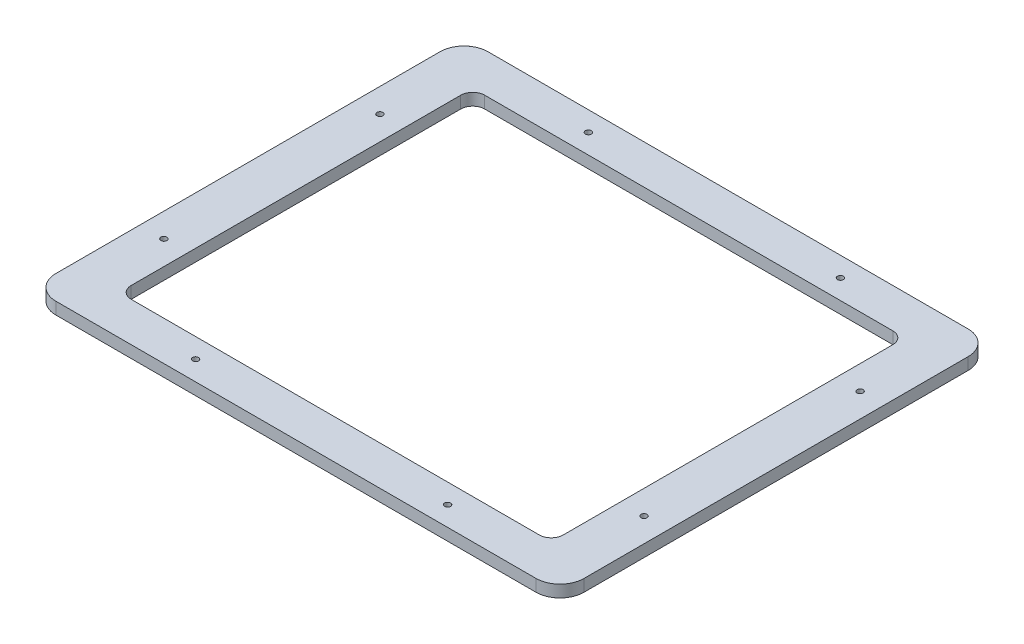
ISO-10303-21;
HEADER;
FILE_DESCRIPTION(('STEP AP214'),'2;1');
FILE_NAME('part.step','',(''),(''),'','','');
FILE_SCHEMA(('AUTOMOTIVE_DESIGN { 1 0 10303 214 1 1 1 1 }'));
ENDSEC;
DATA;
#1=APPLICATION_CONTEXT('core data for automotive mechanical design processes');
#2=APPLICATION_PROTOCOL_DEFINITION('international standard','automotive_design',2000,#1);
#3=PRODUCT_CONTEXT('',#1,'mechanical');
#4=PRODUCT('Part','Part','',(#3));
#5=PRODUCT_RELATED_PRODUCT_CATEGORY('part','',(#4));
#6=PRODUCT_DEFINITION_FORMATION('','',#4);
#7=PRODUCT_DEFINITION_CONTEXT('part definition',#1,'design');
#8=PRODUCT_DEFINITION('design','',#6,#7);
#9=PRODUCT_DEFINITION_SHAPE('','',#8);
#10=(LENGTH_UNIT() NAMED_UNIT(*) SI_UNIT(.MILLI.,.METRE.));
#11=(NAMED_UNIT(*) PLANE_ANGLE_UNIT() SI_UNIT($,.RADIAN.));
#12=(NAMED_UNIT(*) SI_UNIT($,.STERADIAN.) SOLID_ANGLE_UNIT());
#13=UNCERTAINTY_MEASURE_WITH_UNIT(LENGTH_MEASURE(1.E-05),#10,'distance_accuracy_value','');
#14=(GEOMETRIC_REPRESENTATION_CONTEXT(3) GLOBAL_UNCERTAINTY_ASSIGNED_CONTEXT((#13)) GLOBAL_UNIT_ASSIGNED_CONTEXT((#10,
#11,#12)) REPRESENTATION_CONTEXT('',''));
#15=CARTESIAN_POINT('',(0.,0.,0.));
#16=DIRECTION('',(0.,0.,1.));
#17=DIRECTION('',(1.,0.,0.));
#18=AXIS2_PLACEMENT_3D('',#15,#16,#17);
#19=CARTESIAN_POINT('',(0.,6.35,0.));
#20=DIRECTION('',(0.,1.,0.));
#21=DIRECTION('',(0.,0.,1.));
#22=AXIS2_PLACEMENT_3D('',#19,#20,#21);
#23=PLANE('',#22);
#24=CARTESIAN_POINT('',(127.,6.35,57.1500000000001));
#25=DIRECTION('',(0.,1.,0.));
#26=DIRECTION('',(0.,0.,-1.));
#27=AXIS2_PLACEMENT_3D('',#24,#25,#26);
#28=CIRCLE('',#27,1.58749999999999);
#29=CARTESIAN_POINT('',(127.,6.35,55.5625000000001));
#30=VERTEX_POINT('',#29);
#31=EDGE_CURVE('E370',#30,#30,#28,.T.);
#32=ORIENTED_EDGE('',*,*,#31,.F.);
#33=EDGE_LOOP('',(#32));
#34=FACE_BOUND('',#33,.T.);
#35=CARTESIAN_POINT('',(127.,6.35,-57.1500000000001));
#36=DIRECTION('',(0.,1.,0.));
#37=DIRECTION('',(0.,0.,1.));
#38=AXIS2_PLACEMENT_3D('',#35,#36,#37);
#39=CIRCLE('',#38,1.58749999999999);
#40=CARTESIAN_POINT('',(127.,6.35,-55.5625000000001));
#41=VERTEX_POINT('',#40);
#42=EDGE_CURVE('E372',#41,#41,#39,.T.);
#43=ORIENTED_EDGE('',*,*,#42,.F.);
#44=EDGE_LOOP('',(#43));
#45=FACE_BOUND('',#44,.T.);
#46=CARTESIAN_POINT('',(-127.,6.35,57.15));
#47=DIRECTION('',(0.,1.,0.));
#48=DIRECTION('',(0.,0.,-1.));
#49=AXIS2_PLACEMENT_3D('',#46,#47,#48);
#50=CIRCLE('',#49,1.58749999999999);
#51=CARTESIAN_POINT('',(-127.,6.35,55.5625));
#52=VERTEX_POINT('',#51);
#53=EDGE_CURVE('E378',#52,#52,#50,.T.);
#54=ORIENTED_EDGE('',*,*,#53,.F.);
#55=EDGE_LOOP('',(#54));
#56=FACE_BOUND('',#55,.T.);
#57=CARTESIAN_POINT('',(-127.,6.35,-57.15));
#58=DIRECTION('',(0.,1.,0.));
#59=DIRECTION('',(0.,0.,1.));
#60=AXIS2_PLACEMENT_3D('',#57,#58,#59);
#61=CIRCLE('',#60,1.58749999999999);
#62=CARTESIAN_POINT('',(-127.,6.35,-55.5625));
#63=VERTEX_POINT('',#62);
#64=EDGE_CURVE('E384',#63,#63,#61,.T.);
#65=ORIENTED_EDGE('',*,*,#64,.F.);
#66=EDGE_LOOP('',(#65));
#67=FACE_BOUND('',#66,.T.);
#68=CARTESIAN_POINT('',(69.8500000000001,6.35,103.909090909091));
#69=DIRECTION('',(0.,1.,0.));
#70=DIRECTION('',(0.,0.,-1.));
#71=AXIS2_PLACEMENT_3D('',#68,#69,#70);
#72=CIRCLE('',#71,1.58749999999999);
#73=CARTESIAN_POINT('',(69.8500000000001,6.35,102.321590909091));
#74=VERTEX_POINT('',#73);
#75=EDGE_CURVE('E390',#74,#74,#72,.T.);
#76=ORIENTED_EDGE('',*,*,#75,.F.);
#77=EDGE_LOOP('',(#76));
#78=FACE_BOUND('',#77,.T.);
#79=CARTESIAN_POINT('',(69.8500000000001,6.35,-103.909090909091));
#80=DIRECTION('',(0.,1.,0.));
#81=DIRECTION('',(0.,0.,1.));
#82=AXIS2_PLACEMENT_3D('',#79,#80,#81);
#83=CIRCLE('',#82,1.58749999999999);
#84=CARTESIAN_POINT('',(69.8500000000001,6.35,-102.321590909091));
#85=VERTEX_POINT('',#84);
#86=EDGE_CURVE('E396',#85,#85,#83,.T.);
#87=ORIENTED_EDGE('',*,*,#86,.F.);
#88=EDGE_LOOP('',(#87));
#89=FACE_BOUND('',#88,.T.);
#90=CARTESIAN_POINT('',(-63.5,6.35,103.909090909091));
#91=DIRECTION('',(0.,1.,0.));
#92=DIRECTION('',(0.,0.,-1.));
#93=AXIS2_PLACEMENT_3D('',#90,#91,#92);
#94=CIRCLE('',#93,1.58749999999999);
#95=CARTESIAN_POINT('',(-63.5,6.35,102.321590909091));
#96=VERTEX_POINT('',#95);
#97=EDGE_CURVE('E402',#96,#96,#94,.T.);
#98=ORIENTED_EDGE('',*,*,#97,.F.);
#99=EDGE_LOOP('',(#98));
#100=FACE_BOUND('',#99,.T.);
#101=CARTESIAN_POINT('',(-63.5,6.35,-103.909090909091));
#102=DIRECTION('',(0.,1.,0.));
#103=DIRECTION('',(0.,0.,1.));
#104=AXIS2_PLACEMENT_3D('',#101,#102,#103);
#105=CIRCLE('',#104,1.58749999999999);
#106=CARTESIAN_POINT('',(-63.5,6.35,-102.321590909091));
#107=VERTEX_POINT('',#106);
#108=EDGE_CURVE('E408',#107,#107,#105,.T.);
#109=ORIENTED_EDGE('',*,*,#108,.F.);
#110=EDGE_LOOP('',(#109));
#111=FACE_BOUND('',#110,.T.);
#112=DIRECTION('',(0.,0.,1.));
#113=VECTOR('',#112,1.);
#114=CARTESIAN_POINT('',(-139.7,6.35,-114.3));
#115=LINE('',#114,#113);
#116=CARTESIAN_POINT('',(-139.7,6.35,-101.6));
#117=VERTEX_POINT('',#116);
#118=CARTESIAN_POINT('',(-139.7,6.35,101.6));
#119=VERTEX_POINT('',#118);
#120=EDGE_CURVE('E277',#117,#119,#115,.T.);
#121=ORIENTED_EDGE('',*,*,#120,.T.);
#122=CARTESIAN_POINT('',(-127.,6.35,101.6));
#123=DIRECTION('',(0.,1.,0.));
#124=DIRECTION('',(0.,0.,1.));
#125=AXIS2_PLACEMENT_3D('',#122,#123,#124);
#126=CIRCLE('',#125,12.7);
#127=CARTESIAN_POINT('',(-127.,6.35,114.3));
#128=VERTEX_POINT('',#127);
#129=EDGE_CURVE('E197',#119,#128,#126,.T.);
#130=ORIENTED_EDGE('',*,*,#129,.T.);
#131=DIRECTION('',(1.,0.,0.));
#132=VECTOR('',#131,1.);
#133=CARTESIAN_POINT('',(-139.7,6.35,114.3));
#134=LINE('',#133,#132);
#135=CARTESIAN_POINT('',(127.,6.35,114.3));
#136=VERTEX_POINT('',#135);
#137=EDGE_CURVE('E166',#128,#136,#134,.T.);
#138=ORIENTED_EDGE('',*,*,#137,.T.);
#139=CARTESIAN_POINT('',(127.,6.35,101.6));
#140=DIRECTION('',(0.,1.,0.));
#141=DIRECTION('',(0.,0.,1.));
#142=AXIS2_PLACEMENT_3D('',#139,#140,#141);
#143=CIRCLE('',#142,12.7);
#144=CARTESIAN_POINT('',(139.7,6.35,101.6));
#145=VERTEX_POINT('',#144);
#146=EDGE_CURVE('E195',#136,#145,#143,.T.);
#147=ORIENTED_EDGE('',*,*,#146,.T.);
#148=DIRECTION('',(0.,0.,-1.));
#149=VECTOR('',#148,1.);
#150=CARTESIAN_POINT('',(139.7,6.35,-114.3));
#151=LINE('',#150,#149);
#152=CARTESIAN_POINT('',(139.7,6.35,-101.6));
#153=VERTEX_POINT('',#152);
#154=EDGE_CURVE('E173',#145,#153,#151,.T.);
#155=ORIENTED_EDGE('',*,*,#154,.T.);
#156=CARTESIAN_POINT('',(127.,6.35,-101.6));
#157=DIRECTION('',(0.,1.,0.));
#158=DIRECTION('',(0.,0.,1.));
#159=AXIS2_PLACEMENT_3D('',#156,#157,#158);
#160=CIRCLE('',#159,12.7);
#161=CARTESIAN_POINT('',(127.,6.35,-114.3));
#162=VERTEX_POINT('',#161);
#163=EDGE_CURVE('E193',#153,#162,#160,.T.);
#164=ORIENTED_EDGE('',*,*,#163,.T.);
#165=DIRECTION('',(-1.,0.,0.));
#166=VECTOR('',#165,1.);
#167=CARTESIAN_POINT('',(-139.7,6.35,-114.3));
#168=LINE('',#167,#166);
#169=CARTESIAN_POINT('',(-127.,6.35,-114.3));
#170=VERTEX_POINT('',#169);
#171=EDGE_CURVE('E177',#162,#170,#168,.T.);
#172=ORIENTED_EDGE('',*,*,#171,.T.);
#173=CARTESIAN_POINT('',(-127.,6.35,-101.6));
#174=DIRECTION('',(0.,1.,0.));
#175=DIRECTION('',(0.,0.,1.));
#176=AXIS2_PLACEMENT_3D('',#173,#174,#175);
#177=CIRCLE('',#176,12.7);
#178=EDGE_CURVE('E191',#170,#117,#177,.T.);
#179=ORIENTED_EDGE('',*,*,#178,.T.);
#180=EDGE_LOOP('',(#121,#130,#138,#147,#155,#164,#172,#179));
#181=FACE_BOUND('',#180,.T.);
#182=DIRECTION('',(-1.,0.,0.));
#183=VECTOR('',#182,1.);
#184=CARTESIAN_POINT('',(-114.3,6.35,-93.5181818181818));
#185=LINE('',#184,#183);
#186=CARTESIAN_POINT('',(107.95,6.35,-93.5181818181818));
#187=VERTEX_POINT('',#186);
#188=CARTESIAN_POINT('',(-107.95,6.35,-93.5181818181818));
#189=VERTEX_POINT('',#188);
#190=EDGE_CURVE('E255',#187,#189,#185,.T.);
#191=ORIENTED_EDGE('',*,*,#190,.F.);
#192=CARTESIAN_POINT('',(107.95,6.35,-87.1681818181818));
#193=DIRECTION('',(0.,1.,0.));
#194=DIRECTION('',(0.,0.,1.));
#195=AXIS2_PLACEMENT_3D('',#192,#193,#194);
#196=CIRCLE('',#195,6.35);
#197=CARTESIAN_POINT('',(114.3,6.35,-87.1681818181818));
#198=VERTEX_POINT('',#197);
#199=EDGE_CURVE('E238',#187,#198,#196,.F.);
#200=ORIENTED_EDGE('',*,*,#199,.T.);
#201=DIRECTION('',(0.,0.,-1.));
#202=VECTOR('',#201,1.);
#203=CARTESIAN_POINT('',(114.3,6.35,-93.5181818181818));
#204=LINE('',#203,#202);
#205=CARTESIAN_POINT('',(114.3,6.35,87.1681818181818));
#206=VERTEX_POINT('',#205);
#207=EDGE_CURVE('E258',#206,#198,#204,.T.);
#208=ORIENTED_EDGE('',*,*,#207,.F.);
#209=CARTESIAN_POINT('',(107.95,6.35,87.1681818181818));
#210=DIRECTION('',(0.,1.,0.));
#211=DIRECTION('',(0.,0.,1.));
#212=AXIS2_PLACEMENT_3D('',#209,#210,#211);
#213=CIRCLE('',#212,6.35);
#214=CARTESIAN_POINT('',(107.95,6.35,93.5181818181818));
#215=VERTEX_POINT('',#214);
#216=EDGE_CURVE('E234',#206,#215,#213,.F.);
#217=ORIENTED_EDGE('',*,*,#216,.T.);
#218=DIRECTION('',(1.,0.,0.));
#219=VECTOR('',#218,1.);
#220=CARTESIAN_POINT('',(-114.3,6.35,93.5181818181818));
#221=LINE('',#220,#219);
#222=CARTESIAN_POINT('',(-107.95,6.35,93.5181818181818));
#223=VERTEX_POINT('',#222);
#224=EDGE_CURVE('E260',#223,#215,#221,.T.);
#225=ORIENTED_EDGE('',*,*,#224,.F.);
#226=CARTESIAN_POINT('',(-107.95,6.35,87.1681818181818));
#227=DIRECTION('',(0.,1.,0.));
#228=DIRECTION('',(0.,0.,1.));
#229=AXIS2_PLACEMENT_3D('',#226,#227,#228);
#230=CIRCLE('',#229,6.35);
#231=CARTESIAN_POINT('',(-114.3,6.35,87.1681818181818));
#232=VERTEX_POINT('',#231);
#233=EDGE_CURVE('E230',#223,#232,#230,.F.);
#234=ORIENTED_EDGE('',*,*,#233,.T.);
#235=DIRECTION('',(0.,0.,1.));
#236=VECTOR('',#235,1.);
#237=CARTESIAN_POINT('',(-114.3,6.35,-93.5181818181818));
#238=LINE('',#237,#236);
#239=CARTESIAN_POINT('',(-114.3,6.35,-87.1681818181818));
#240=VERTEX_POINT('',#239);
#241=EDGE_CURVE('E257',#240,#232,#238,.T.);
#242=ORIENTED_EDGE('',*,*,#241,.F.);
#243=CARTESIAN_POINT('',(-107.95,6.35,-87.1681818181818));
#244=DIRECTION('',(0.,1.,0.));
#245=DIRECTION('',(0.,0.,1.));
#246=AXIS2_PLACEMENT_3D('',#243,#244,#245);
#247=CIRCLE('',#246,6.35);
#248=EDGE_CURVE('E11',#240,#189,#247,.F.);
#249=ORIENTED_EDGE('',*,*,#248,.T.);
#250=EDGE_LOOP('',(#191,#200,#208,#217,#225,#234,#242,#249));
#251=FACE_BOUND('',#250,.T.);
#252=ADVANCED_FACE('F33',(#34,#45,#56,#67,#78,#89,#100,#111,#181,#251),#23,.T.);
#253=CARTESIAN_POINT('',(0.,0.,0.));
#254=DIRECTION('',(0.,1.,0.));
#255=DIRECTION('',(0.,0.,1.));
#256=AXIS2_PLACEMENT_3D('',#253,#254,#255);
#257=PLANE('',#256);
#258=CARTESIAN_POINT('',(127.,0.,57.1500000000001));
#259=DIRECTION('',(0.,1.,0.));
#260=DIRECTION('',(0.,0.,-1.));
#261=AXIS2_PLACEMENT_3D('',#258,#259,#260);
#262=CIRCLE('',#261,1.58749999999999);
#263=CARTESIAN_POINT('',(127.,0.,55.5625000000001));
#264=VERTEX_POINT('',#263);
#265=EDGE_CURVE('E368',#264,#264,#262,.T.);
#266=ORIENTED_EDGE('',*,*,#265,.T.);
#267=EDGE_LOOP('',(#266));
#268=FACE_BOUND('',#267,.T.);
#269=CARTESIAN_POINT('',(127.,0.,-57.1500000000001));
#270=DIRECTION('',(0.,1.,0.));
#271=DIRECTION('',(0.,0.,1.));
#272=AXIS2_PLACEMENT_3D('',#269,#270,#271);
#273=CIRCLE('',#272,1.58749999999999);
#274=CARTESIAN_POINT('',(127.,0.,-55.5625000000001));
#275=VERTEX_POINT('',#274);
#276=EDGE_CURVE('E375',#275,#275,#273,.T.);
#277=ORIENTED_EDGE('',*,*,#276,.T.);
#278=EDGE_LOOP('',(#277));
#279=FACE_BOUND('',#278,.T.);
#280=CARTESIAN_POINT('',(-127.,0.,57.15));
#281=DIRECTION('',(0.,1.,0.));
#282=DIRECTION('',(0.,0.,-1.));
#283=AXIS2_PLACEMENT_3D('',#280,#281,#282);
#284=CIRCLE('',#283,1.58749999999999);
#285=CARTESIAN_POINT('',(-127.,0.,55.5625));
#286=VERTEX_POINT('',#285);
#287=EDGE_CURVE('E381',#286,#286,#284,.T.);
#288=ORIENTED_EDGE('',*,*,#287,.T.);
#289=EDGE_LOOP('',(#288));
#290=FACE_BOUND('',#289,.T.);
#291=CARTESIAN_POINT('',(-127.,0.,-57.15));
#292=DIRECTION('',(0.,1.,0.));
#293=DIRECTION('',(0.,0.,1.));
#294=AXIS2_PLACEMENT_3D('',#291,#292,#293);
#295=CIRCLE('',#294,1.58749999999999);
#296=CARTESIAN_POINT('',(-127.,0.,-55.5625));
#297=VERTEX_POINT('',#296);
#298=EDGE_CURVE('E387',#297,#297,#295,.T.);
#299=ORIENTED_EDGE('',*,*,#298,.T.);
#300=EDGE_LOOP('',(#299));
#301=FACE_BOUND('',#300,.T.);
#302=CARTESIAN_POINT('',(69.8500000000001,0.,103.909090909091));
#303=DIRECTION('',(0.,1.,0.));
#304=DIRECTION('',(0.,0.,-1.));
#305=AXIS2_PLACEMENT_3D('',#302,#303,#304);
#306=CIRCLE('',#305,1.58749999999999);
#307=CARTESIAN_POINT('',(69.8500000000001,0.,102.321590909091));
#308=VERTEX_POINT('',#307);
#309=EDGE_CURVE('E393',#308,#308,#306,.T.);
#310=ORIENTED_EDGE('',*,*,#309,.T.);
#311=EDGE_LOOP('',(#310));
#312=FACE_BOUND('',#311,.T.);
#313=CARTESIAN_POINT('',(69.8500000000001,0.,-103.909090909091));
#314=DIRECTION('',(0.,1.,0.));
#315=DIRECTION('',(0.,0.,1.));
#316=AXIS2_PLACEMENT_3D('',#313,#314,#315);
#317=CIRCLE('',#316,1.58749999999999);
#318=CARTESIAN_POINT('',(69.8500000000001,0.,-102.321590909091));
#319=VERTEX_POINT('',#318);
#320=EDGE_CURVE('E399',#319,#319,#317,.T.);
#321=ORIENTED_EDGE('',*,*,#320,.T.);
#322=EDGE_LOOP('',(#321));
#323=FACE_BOUND('',#322,.T.);
#324=CARTESIAN_POINT('',(-63.5,0.,103.909090909091));
#325=DIRECTION('',(0.,1.,0.));
#326=DIRECTION('',(0.,0.,-1.));
#327=AXIS2_PLACEMENT_3D('',#324,#325,#326);
#328=CIRCLE('',#327,1.58749999999999);
#329=CARTESIAN_POINT('',(-63.5,0.,102.321590909091));
#330=VERTEX_POINT('',#329);
#331=EDGE_CURVE('E405',#330,#330,#328,.T.);
#332=ORIENTED_EDGE('',*,*,#331,.T.);
#333=EDGE_LOOP('',(#332));
#334=FACE_BOUND('',#333,.T.);
#335=CARTESIAN_POINT('',(-63.5,0.,-103.909090909091));
#336=DIRECTION('',(0.,1.,0.));
#337=DIRECTION('',(0.,0.,1.));
#338=AXIS2_PLACEMENT_3D('',#335,#336,#337);
#339=CIRCLE('',#338,1.58749999999999);
#340=CARTESIAN_POINT('',(-63.5,0.,-102.321590909091));
#341=VERTEX_POINT('',#340);
#342=EDGE_CURVE('E272',#341,#341,#339,.T.);
#343=ORIENTED_EDGE('',*,*,#342,.T.);
#344=EDGE_LOOP('',(#343));
#345=FACE_BOUND('',#344,.T.);
#346=DIRECTION('',(1.,0.,0.));
#347=VECTOR('',#346,1.);
#348=CARTESIAN_POINT('',(-139.7,0.,114.3));
#349=LINE('',#348,#347);
#350=CARTESIAN_POINT('',(-127.,0.,114.3));
#351=VERTEX_POINT('',#350);
#352=CARTESIAN_POINT('',(127.,0.,114.3));
#353=VERTEX_POINT('',#352);
#354=EDGE_CURVE('E163',#351,#353,#349,.T.);
#355=ORIENTED_EDGE('',*,*,#354,.F.);
#356=CARTESIAN_POINT('',(-127.,0.,101.6));
#357=DIRECTION('',(0.,1.,0.));
#358=DIRECTION('',(0.,0.,1.));
#359=AXIS2_PLACEMENT_3D('',#356,#357,#358);
#360=CIRCLE('',#359,12.7);
#361=CARTESIAN_POINT('',(-139.7,0.,101.6));
#362=VERTEX_POINT('',#361);
#363=EDGE_CURVE('E146',#351,#362,#360,.F.);
#364=ORIENTED_EDGE('',*,*,#363,.T.);
#365=DIRECTION('',(0.,0.,1.));
#366=VECTOR('',#365,1.);
#367=CARTESIAN_POINT('',(-139.7,0.,-114.3));
#368=LINE('',#367,#366);
#369=CARTESIAN_POINT('',(-139.7,0.,-101.6));
#370=VERTEX_POINT('',#369);
#371=EDGE_CURVE('E174',#370,#362,#368,.T.);
#372=ORIENTED_EDGE('',*,*,#371,.F.);
#373=CARTESIAN_POINT('',(-127.,0.,-101.6));
#374=DIRECTION('',(0.,1.,0.));
#375=DIRECTION('',(0.,0.,1.));
#376=AXIS2_PLACEMENT_3D('',#373,#374,#375);
#377=CIRCLE('',#376,12.7);
#378=CARTESIAN_POINT('',(-127.,0.,-114.3));
#379=VERTEX_POINT('',#378);
#380=EDGE_CURVE('E167',#370,#379,#377,.F.);
#381=ORIENTED_EDGE('',*,*,#380,.T.);
#382=DIRECTION('',(-1.,0.,0.));
#383=VECTOR('',#382,1.);
#384=CARTESIAN_POINT('',(-139.7,0.,-114.3));
#385=LINE('',#384,#383);
#386=CARTESIAN_POINT('',(127.,0.,-114.3));
#387=VERTEX_POINT('',#386);
#388=EDGE_CURVE('E179',#387,#379,#385,.T.);
#389=ORIENTED_EDGE('',*,*,#388,.F.);
#390=CARTESIAN_POINT('',(127.,0.,-101.6));
#391=DIRECTION('',(0.,1.,0.));
#392=DIRECTION('',(0.,0.,1.));
#393=AXIS2_PLACEMENT_3D('',#390,#391,#392);
#394=CIRCLE('',#393,12.7);
#395=CARTESIAN_POINT('',(139.7,0.,-101.6));
#396=VERTEX_POINT('',#395);
#397=EDGE_CURVE('E185',#387,#396,#394,.F.);
#398=ORIENTED_EDGE('',*,*,#397,.T.);
#399=DIRECTION('',(0.,0.,-1.));
#400=VECTOR('',#399,1.);
#401=CARTESIAN_POINT('',(139.7,0.,-114.3));
#402=LINE('',#401,#400);
#403=CARTESIAN_POINT('',(139.7,0.,101.6));
#404=VERTEX_POINT('',#403);
#405=EDGE_CURVE('E268',#404,#396,#402,.T.);
#406=ORIENTED_EDGE('',*,*,#405,.F.);
#407=CARTESIAN_POINT('',(127.,0.,101.6));
#408=DIRECTION('',(0.,1.,0.));
#409=DIRECTION('',(0.,0.,1.));
#410=AXIS2_PLACEMENT_3D('',#407,#408,#409);
#411=CIRCLE('',#410,12.7);
#412=EDGE_CURVE('E157',#404,#353,#411,.F.);
#413=ORIENTED_EDGE('',*,*,#412,.T.);
#414=EDGE_LOOP('',(#355,#364,#372,#381,#389,#398,#406,#413));
#415=FACE_BOUND('',#414,.T.);
#416=DIRECTION('',(1.,0.,0.));
#417=VECTOR('',#416,1.);
#418=CARTESIAN_POINT('',(-114.3,0.,93.5181818181818));
#419=LINE('',#418,#417);
#420=CARTESIAN_POINT('',(-107.95,0.,93.5181818181818));
#421=VERTEX_POINT('',#420);
#422=CARTESIAN_POINT('',(107.95,0.,93.5181818181818));
#423=VERTEX_POINT('',#422);
#424=EDGE_CURVE('E252',#421,#423,#419,.T.);
#425=ORIENTED_EDGE('',*,*,#424,.T.);
#426=CARTESIAN_POINT('',(107.95,0.,87.1681818181818));
#427=DIRECTION('',(0.,1.,0.));
#428=DIRECTION('',(0.,0.,1.));
#429=AXIS2_PLACEMENT_3D('',#426,#427,#428);
#430=CIRCLE('',#429,6.35);
#431=CARTESIAN_POINT('',(114.3,0.,87.1681818181818));
#432=VERTEX_POINT('',#431);
#433=EDGE_CURVE('E232',#423,#432,#430,.T.);
#434=ORIENTED_EDGE('',*,*,#433,.T.);
#435=DIRECTION('',(0.,0.,-1.));
#436=VECTOR('',#435,1.);
#437=CARTESIAN_POINT('',(114.3,0.,-93.5181818181818));
#438=LINE('',#437,#436);
#439=CARTESIAN_POINT('',(114.3,0.,-87.1681818181818));
#440=VERTEX_POINT('',#439);
#441=EDGE_CURVE('E269',#432,#440,#438,.T.);
#442=ORIENTED_EDGE('',*,*,#441,.T.);
#443=CARTESIAN_POINT('',(107.95,0.,-87.1681818181818));
#444=DIRECTION('',(0.,1.,0.));
#445=DIRECTION('',(0.,0.,1.));
#446=AXIS2_PLACEMENT_3D('',#443,#444,#445);
#447=CIRCLE('',#446,6.35);
#448=CARTESIAN_POINT('',(107.95,0.,-93.5181818181818));
#449=VERTEX_POINT('',#448);
#450=EDGE_CURVE('E236',#440,#449,#447,.T.);
#451=ORIENTED_EDGE('',*,*,#450,.T.);
#452=DIRECTION('',(-1.,0.,0.));
#453=VECTOR('',#452,1.);
#454=CARTESIAN_POINT('',(-114.3,0.,-93.5181818181818));
#455=LINE('',#454,#453);
#456=CARTESIAN_POINT('',(-107.95,0.,-93.5181818181818));
#457=VERTEX_POINT('',#456);
#458=EDGE_CURVE('E244',#449,#457,#455,.T.);
#459=ORIENTED_EDGE('',*,*,#458,.T.);
#460=CARTESIAN_POINT('',(-107.95,0.,-87.1681818181818));
#461=DIRECTION('',(0.,1.,0.));
#462=DIRECTION('',(0.,0.,1.));
#463=AXIS2_PLACEMENT_3D('',#460,#461,#462);
#464=CIRCLE('',#463,6.35);
#465=CARTESIAN_POINT('',(-114.3,0.,-87.1681818181818));
#466=VERTEX_POINT('',#465);
#467=EDGE_CURVE('E41',#457,#466,#464,.T.);
#468=ORIENTED_EDGE('',*,*,#467,.T.);
#469=DIRECTION('',(0.,0.,1.));
#470=VECTOR('',#469,1.);
#471=CARTESIAN_POINT('',(-114.3,0.,-93.5181818181818));
#472=LINE('',#471,#470);
#473=CARTESIAN_POINT('',(-114.3,0.,87.1681818181818));
#474=VERTEX_POINT('',#473);
#475=EDGE_CURVE('E243',#466,#474,#472,.T.);
#476=ORIENTED_EDGE('',*,*,#475,.T.);
#477=CARTESIAN_POINT('',(-107.95,0.,87.1681818181818));
#478=DIRECTION('',(0.,1.,0.));
#479=DIRECTION('',(0.,0.,1.));
#480=AXIS2_PLACEMENT_3D('',#477,#478,#479);
#481=CIRCLE('',#480,6.35);
#482=EDGE_CURVE('E228',#474,#421,#481,.T.);
#483=ORIENTED_EDGE('',*,*,#482,.T.);
#484=EDGE_LOOP('',(#425,#434,#442,#451,#459,#468,#476,#483));
#485=FACE_BOUND('',#484,.T.);
#486=ADVANCED_FACE('F170',(#268,#279,#290,#301,#312,#323,#334,#345,#415,#485),#257,.F.);
#487=CARTESIAN_POINT('',(139.7,6.35,-114.3));
#488=DIRECTION('',(-1.,0.,0.));
#489=DIRECTION('',(0.,0.,1.));
#490=AXIS2_PLACEMENT_3D('',#487,#488,#489);
#491=PLANE('',#490);
#492=ORIENTED_EDGE('',*,*,#154,.F.);
#493=DIRECTION('',(0.,-1.,0.));
#494=VECTOR('',#493,1.);
#495=CARTESIAN_POINT('',(139.7,6.35,101.6));
#496=LINE('',#495,#494);
#497=EDGE_CURVE('E201',#145,#404,#496,.T.);
#498=ORIENTED_EDGE('',*,*,#497,.T.);
#499=ORIENTED_EDGE('',*,*,#405,.T.);
#500=DIRECTION('',(0.,-1.,0.));
#501=VECTOR('',#500,1.);
#502=CARTESIAN_POINT('',(139.7,6.35,-101.6));
#503=LINE('',#502,#501);
#504=EDGE_CURVE('E199',#396,#153,#503,.F.);
#505=ORIENTED_EDGE('',*,*,#504,.T.);
#506=EDGE_LOOP('',(#492,#498,#499,#505));
#507=FACE_BOUND('',#506,.T.);
#508=ADVANCED_FACE('F305',(#507),#491,.F.);
#509=CARTESIAN_POINT('',(-139.7,6.35,-114.3));
#510=DIRECTION('',(0.,0.,1.));
#511=DIRECTION('',(1.,0.,0.));
#512=AXIS2_PLACEMENT_3D('',#509,#510,#511);
#513=PLANE('',#512);
#514=ORIENTED_EDGE('',*,*,#171,.F.);
#515=DIRECTION('',(0.,-1.,0.));
#516=VECTOR('',#515,1.);
#517=CARTESIAN_POINT('',(127.,6.35,-114.3));
#518=LINE('',#517,#516);
#519=EDGE_CURVE('E206',#162,#387,#518,.T.);
#520=ORIENTED_EDGE('',*,*,#519,.T.);
#521=ORIENTED_EDGE('',*,*,#388,.T.);
#522=DIRECTION('',(0.,-1.,0.));
#523=VECTOR('',#522,1.);
#524=CARTESIAN_POINT('',(-127.,6.35,-114.3));
#525=LINE('',#524,#523);
#526=EDGE_CURVE('E204',#379,#170,#525,.F.);
#527=ORIENTED_EDGE('',*,*,#526,.T.);
#528=EDGE_LOOP('',(#514,#520,#521,#527));
#529=FACE_BOUND('',#528,.T.);
#530=ADVANCED_FACE('F287',(#529),#513,.F.);
#531=CARTESIAN_POINT('',(-139.7,6.35,-114.3));
#532=DIRECTION('',(1.,0.,0.));
#533=DIRECTION('',(0.,0.,-1.));
#534=AXIS2_PLACEMENT_3D('',#531,#532,#533);
#535=PLANE('',#534);
#536=ORIENTED_EDGE('',*,*,#371,.T.);
#537=DIRECTION('',(0.,-1.,0.));
#538=VECTOR('',#537,1.);
#539=CARTESIAN_POINT('',(-139.7,6.35,101.6));
#540=LINE('',#539,#538);
#541=EDGE_CURVE('E151',#362,#119,#540,.F.);
#542=ORIENTED_EDGE('',*,*,#541,.T.);
#543=ORIENTED_EDGE('',*,*,#120,.F.);
#544=DIRECTION('',(0.,-1.,0.));
#545=VECTOR('',#544,1.);
#546=CARTESIAN_POINT('',(-139.7,6.35,-101.6));
#547=LINE('',#546,#545);
#548=EDGE_CURVE('E156',#117,#370,#547,.T.);
#549=ORIENTED_EDGE('',*,*,#548,.T.);
#550=EDGE_LOOP('',(#536,#542,#543,#549));
#551=FACE_BOUND('',#550,.T.);
#552=ADVANCED_FACE('F296',(#551),#535,.F.);
#553=CARTESIAN_POINT('',(-139.7,6.35,114.3));
#554=DIRECTION('',(0.,0.,-1.));
#555=DIRECTION('',(-1.,0.,0.));
#556=AXIS2_PLACEMENT_3D('',#553,#554,#555);
#557=PLANE('',#556);
#558=ORIENTED_EDGE('',*,*,#137,.F.);
#559=DIRECTION('',(0.,-1.,0.));
#560=VECTOR('',#559,1.);
#561=CARTESIAN_POINT('',(-127.,6.35,114.3));
#562=LINE('',#561,#560);
#563=EDGE_CURVE('E150',#128,#351,#562,.T.);
#564=ORIENTED_EDGE('',*,*,#563,.T.);
#565=ORIENTED_EDGE('',*,*,#354,.T.);
#566=DIRECTION('',(0.,-1.,0.));
#567=VECTOR('',#566,1.);
#568=CARTESIAN_POINT('',(127.,6.35,114.3));
#569=LINE('',#568,#567);
#570=EDGE_CURVE('E168',#353,#136,#569,.F.);
#571=ORIENTED_EDGE('',*,*,#570,.T.);
#572=EDGE_LOOP('',(#558,#564,#565,#571));
#573=FACE_BOUND('',#572,.T.);
#574=ADVANCED_FACE('F162',(#573),#557,.F.);
#575=CARTESIAN_POINT('',(114.3,6.35,-93.5181818181818));
#576=DIRECTION('',(-1.,0.,0.));
#577=DIRECTION('',(0.,0.,1.));
#578=AXIS2_PLACEMENT_3D('',#575,#576,#577);
#579=PLANE('',#578);
#580=ORIENTED_EDGE('',*,*,#441,.F.);
#581=DIRECTION('',(0.,-1.,0.));
#582=VECTOR('',#581,1.);
#583=CARTESIAN_POINT('',(114.3,6.35,87.1681818181818));
#584=LINE('',#583,#582);
#585=EDGE_CURVE('E222',#432,#206,#584,.F.);
#586=ORIENTED_EDGE('',*,*,#585,.T.);
#587=ORIENTED_EDGE('',*,*,#207,.T.);
#588=DIRECTION('',(0.,-1.,0.));
#589=VECTOR('',#588,1.);
#590=CARTESIAN_POINT('',(114.3,0.,-87.1681818181818));
#591=LINE('',#590,#589);
#592=EDGE_CURVE('E219',#198,#440,#591,.T.);
#593=ORIENTED_EDGE('',*,*,#592,.T.);
#594=EDGE_LOOP('',(#580,#586,#587,#593));
#595=FACE_BOUND('',#594,.T.);
#596=ADVANCED_FACE('F303',(#595),#579,.T.);
#597=CARTESIAN_POINT('',(-114.3,6.35,-93.5181818181818));
#598=DIRECTION('',(0.,0.,1.));
#599=DIRECTION('',(1.,0.,0.));
#600=AXIS2_PLACEMENT_3D('',#597,#598,#599);
#601=PLANE('',#600);
#602=ORIENTED_EDGE('',*,*,#458,.F.);
#603=DIRECTION('',(0.,-1.,0.));
#604=VECTOR('',#603,1.);
#605=CARTESIAN_POINT('',(107.95,6.35,-93.5181818181818));
#606=LINE('',#605,#604);
#607=EDGE_CURVE('E53',#449,#187,#606,.F.);
#608=ORIENTED_EDGE('',*,*,#607,.T.);
#609=ORIENTED_EDGE('',*,*,#190,.T.);
#610=DIRECTION('',(0.,-1.,0.));
#611=VECTOR('',#610,1.);
#612=CARTESIAN_POINT('',(-107.95,0.,-93.5181818181818));
#613=LINE('',#612,#611);
#614=EDGE_CURVE('E224',#189,#457,#613,.T.);
#615=ORIENTED_EDGE('',*,*,#614,.T.);
#616=EDGE_LOOP('',(#602,#608,#609,#615));
#617=FACE_BOUND('',#616,.T.);
#618=ADVANCED_FACE('F254',(#617),#601,.T.);
#619=CARTESIAN_POINT('',(-114.3,6.35,-93.5181818181818));
#620=DIRECTION('',(1.,0.,0.));
#621=DIRECTION('',(0.,0.,-1.));
#622=AXIS2_PLACEMENT_3D('',#619,#620,#621);
#623=PLANE('',#622);
#624=ORIENTED_EDGE('',*,*,#241,.T.);
#625=DIRECTION('',(0.,-1.,0.));
#626=VECTOR('',#625,1.);
#627=CARTESIAN_POINT('',(-114.3,0.,87.1681818181818));
#628=LINE('',#627,#626);
#629=EDGE_CURVE('E211',#232,#474,#628,.T.);
#630=ORIENTED_EDGE('',*,*,#629,.T.);
#631=ORIENTED_EDGE('',*,*,#475,.F.);
#632=DIRECTION('',(0.,-1.,0.));
#633=VECTOR('',#632,1.);
#634=CARTESIAN_POINT('',(-114.3,6.35,-87.1681818181818));
#635=LINE('',#634,#633);
#636=EDGE_CURVE('E209',#466,#240,#635,.F.);
#637=ORIENTED_EDGE('',*,*,#636,.T.);
#638=EDGE_LOOP('',(#624,#630,#631,#637));
#639=FACE_BOUND('',#638,.T.);
#640=ADVANCED_FACE('F250',(#639),#623,.T.);
#641=CARTESIAN_POINT('',(-114.3,6.35,93.5181818181818));
#642=DIRECTION('',(0.,0.,-1.));
#643=DIRECTION('',(-1.,0.,0.));
#644=AXIS2_PLACEMENT_3D('',#641,#642,#643);
#645=PLANE('',#644);
#646=ORIENTED_EDGE('',*,*,#424,.F.);
#647=DIRECTION('',(0.,-1.,0.));
#648=VECTOR('',#647,1.);
#649=CARTESIAN_POINT('',(-107.95,6.35,93.5181818181818));
#650=LINE('',#649,#648);
#651=EDGE_CURVE('E217',#421,#223,#650,.F.);
#652=ORIENTED_EDGE('',*,*,#651,.T.);
#653=ORIENTED_EDGE('',*,*,#224,.T.);
#654=DIRECTION('',(0.,-1.,0.));
#655=VECTOR('',#654,1.);
#656=CARTESIAN_POINT('',(107.95,0.,93.5181818181818));
#657=LINE('',#656,#655);
#658=EDGE_CURVE('E214',#215,#423,#657,.T.);
#659=ORIENTED_EDGE('',*,*,#658,.T.);
#660=EDGE_LOOP('',(#646,#652,#653,#659));
#661=FACE_BOUND('',#660,.T.);
#662=ADVANCED_FACE('F325',(#661),#645,.T.);
#663=CARTESIAN_POINT('',(-63.5,0.,-103.909090909091));
#664=DIRECTION('',(0.,1.,0.));
#665=DIRECTION('',(0.,0.,1.));
#666=AXIS2_PLACEMENT_3D('',#663,#664,#665);
#667=CYLINDRICAL_SURFACE('',#666,1.58749999999999);
#668=ORIENTED_EDGE('',*,*,#342,.F.);
#669=EDGE_LOOP('',(#668));
#670=FACE_BOUND('',#669,.T.);
#671=ORIENTED_EDGE('',*,*,#108,.T.);
#672=EDGE_LOOP('',(#671));
#673=FACE_BOUND('',#672,.T.);
#674=ADVANCED_FACE('F328',(#670,#673),#667,.F.);
#675=CARTESIAN_POINT('',(-63.5,0.,103.909090909091));
#676=DIRECTION('',(0.,1.,0.));
#677=DIRECTION('',(0.,0.,1.));
#678=AXIS2_PLACEMENT_3D('',#675,#676,#677);
#679=CYLINDRICAL_SURFACE('',#678,1.58749999999999);
#680=ORIENTED_EDGE('',*,*,#331,.F.);
#681=EDGE_LOOP('',(#680));
#682=FACE_BOUND('',#681,.T.);
#683=ORIENTED_EDGE('',*,*,#97,.T.);
#684=EDGE_LOOP('',(#683));
#685=FACE_BOUND('',#684,.T.);
#686=ADVANCED_FACE('F332',(#682,#685),#679,.F.);
#687=CARTESIAN_POINT('',(69.8500000000001,0.,-103.909090909091));
#688=DIRECTION('',(0.,1.,0.));
#689=DIRECTION('',(0.,0.,1.));
#690=AXIS2_PLACEMENT_3D('',#687,#688,#689);
#691=CYLINDRICAL_SURFACE('',#690,1.58749999999999);
#692=ORIENTED_EDGE('',*,*,#320,.F.);
#693=EDGE_LOOP('',(#692));
#694=FACE_BOUND('',#693,.T.);
#695=ORIENTED_EDGE('',*,*,#86,.T.);
#696=EDGE_LOOP('',(#695));
#697=FACE_BOUND('',#696,.T.);
#698=ADVANCED_FACE('F336',(#694,#697),#691,.F.);
#699=CARTESIAN_POINT('',(69.8500000000001,0.,103.909090909091));
#700=DIRECTION('',(0.,1.,0.));
#701=DIRECTION('',(0.,0.,1.));
#702=AXIS2_PLACEMENT_3D('',#699,#700,#701);
#703=CYLINDRICAL_SURFACE('',#702,1.58749999999999);
#704=ORIENTED_EDGE('',*,*,#309,.F.);
#705=EDGE_LOOP('',(#704));
#706=FACE_BOUND('',#705,.T.);
#707=ORIENTED_EDGE('',*,*,#75,.T.);
#708=EDGE_LOOP('',(#707));
#709=FACE_BOUND('',#708,.T.);
#710=ADVANCED_FACE('F340',(#706,#709),#703,.F.);
#711=CARTESIAN_POINT('',(-127.,0.,-57.15));
#712=DIRECTION('',(0.,1.,0.));
#713=DIRECTION('',(0.,0.,1.));
#714=AXIS2_PLACEMENT_3D('',#711,#712,#713);
#715=CYLINDRICAL_SURFACE('',#714,1.58749999999999);
#716=ORIENTED_EDGE('',*,*,#298,.F.);
#717=EDGE_LOOP('',(#716));
#718=FACE_BOUND('',#717,.T.);
#719=ORIENTED_EDGE('',*,*,#64,.T.);
#720=EDGE_LOOP('',(#719));
#721=FACE_BOUND('',#720,.T.);
#722=ADVANCED_FACE('F344',(#718,#721),#715,.F.);
#723=CARTESIAN_POINT('',(-127.,0.,57.15));
#724=DIRECTION('',(0.,1.,0.));
#725=DIRECTION('',(0.,0.,1.));
#726=AXIS2_PLACEMENT_3D('',#723,#724,#725);
#727=CYLINDRICAL_SURFACE('',#726,1.58749999999999);
#728=ORIENTED_EDGE('',*,*,#287,.F.);
#729=EDGE_LOOP('',(#728));
#730=FACE_BOUND('',#729,.T.);
#731=ORIENTED_EDGE('',*,*,#53,.T.);
#732=EDGE_LOOP('',(#731));
#733=FACE_BOUND('',#732,.T.);
#734=ADVANCED_FACE('F348',(#730,#733),#727,.F.);
#735=CARTESIAN_POINT('',(127.,0.,-57.1500000000001));
#736=DIRECTION('',(0.,1.,0.));
#737=DIRECTION('',(0.,0.,1.));
#738=AXIS2_PLACEMENT_3D('',#735,#736,#737);
#739=CYLINDRICAL_SURFACE('',#738,1.58749999999999);
#740=ORIENTED_EDGE('',*,*,#276,.F.);
#741=EDGE_LOOP('',(#740));
#742=FACE_BOUND('',#741,.T.);
#743=ORIENTED_EDGE('',*,*,#42,.T.);
#744=EDGE_LOOP('',(#743));
#745=FACE_BOUND('',#744,.T.);
#746=ADVANCED_FACE('F352',(#742,#745),#739,.F.);
#747=CARTESIAN_POINT('',(127.,0.,57.1500000000001));
#748=DIRECTION('',(0.,1.,0.));
#749=DIRECTION('',(0.,0.,1.));
#750=AXIS2_PLACEMENT_3D('',#747,#748,#749);
#751=CYLINDRICAL_SURFACE('',#750,1.58749999999999);
#752=ORIENTED_EDGE('',*,*,#265,.F.);
#753=EDGE_LOOP('',(#752));
#754=FACE_BOUND('',#753,.T.);
#755=ORIENTED_EDGE('',*,*,#31,.T.);
#756=EDGE_LOOP('',(#755));
#757=FACE_BOUND('',#756,.T.);
#758=ADVANCED_FACE('F356',(#754,#757),#751,.F.);
#759=CARTESIAN_POINT('',(-127.,6.35,101.6));
#760=DIRECTION('',(0.,-1.,0.));
#761=DIRECTION('',(0.,0.,-1.));
#762=AXIS2_PLACEMENT_3D('',#759,#760,#761);
#763=CYLINDRICAL_SURFACE('',#762,12.7);
#764=ORIENTED_EDGE('',*,*,#129,.F.);
#765=ORIENTED_EDGE('',*,*,#541,.F.);
#766=ORIENTED_EDGE('',*,*,#363,.F.);
#767=ORIENTED_EDGE('',*,*,#563,.F.);
#768=EDGE_LOOP('',(#764,#765,#766,#767));
#769=FACE_BOUND('',#768,.T.);
#770=ADVANCED_FACE('F149',(#769),#763,.T.);
#771=CARTESIAN_POINT('',(127.,6.35,101.6));
#772=DIRECTION('',(0.,-1.,0.));
#773=DIRECTION('',(0.,0.,-1.));
#774=AXIS2_PLACEMENT_3D('',#771,#772,#773);
#775=CYLINDRICAL_SURFACE('',#774,12.7);
#776=ORIENTED_EDGE('',*,*,#146,.F.);
#777=ORIENTED_EDGE('',*,*,#570,.F.);
#778=ORIENTED_EDGE('',*,*,#412,.F.);
#779=ORIENTED_EDGE('',*,*,#497,.F.);
#780=EDGE_LOOP('',(#776,#777,#778,#779));
#781=FACE_BOUND('',#780,.T.);
#782=ADVANCED_FACE('F363',(#781),#775,.T.);
#783=CARTESIAN_POINT('',(127.,6.35,-101.6));
#784=DIRECTION('',(0.,-1.,0.));
#785=DIRECTION('',(0.,0.,-1.));
#786=AXIS2_PLACEMENT_3D('',#783,#784,#785);
#787=CYLINDRICAL_SURFACE('',#786,12.7);
#788=ORIENTED_EDGE('',*,*,#163,.F.);
#789=ORIENTED_EDGE('',*,*,#504,.F.);
#790=ORIENTED_EDGE('',*,*,#397,.F.);
#791=ORIENTED_EDGE('',*,*,#519,.F.);
#792=EDGE_LOOP('',(#788,#789,#790,#791));
#793=FACE_BOUND('',#792,.T.);
#794=ADVANCED_FACE('F450',(#793),#787,.T.);
#795=CARTESIAN_POINT('',(-127.,6.35,-101.6));
#796=DIRECTION('',(0.,-1.,0.));
#797=DIRECTION('',(0.,0.,-1.));
#798=AXIS2_PLACEMENT_3D('',#795,#796,#797);
#799=CYLINDRICAL_SURFACE('',#798,12.7);
#800=ORIENTED_EDGE('',*,*,#178,.F.);
#801=ORIENTED_EDGE('',*,*,#526,.F.);
#802=ORIENTED_EDGE('',*,*,#380,.F.);
#803=ORIENTED_EDGE('',*,*,#548,.F.);
#804=EDGE_LOOP('',(#800,#801,#802,#803));
#805=FACE_BOUND('',#804,.T.);
#806=ADVANCED_FACE('F291',(#805),#799,.T.);
#807=CARTESIAN_POINT('',(-107.95,6.35,87.1681818181818));
#808=DIRECTION('',(0.,1.,0.));
#809=DIRECTION('',(0.,0.,1.));
#810=AXIS2_PLACEMENT_3D('',#807,#808,#809);
#811=CYLINDRICAL_SURFACE('',#810,6.35);
#812=ORIENTED_EDGE('',*,*,#233,.F.);
#813=ORIENTED_EDGE('',*,*,#651,.F.);
#814=ORIENTED_EDGE('',*,*,#482,.F.);
#815=ORIENTED_EDGE('',*,*,#629,.F.);
#816=EDGE_LOOP('',(#812,#813,#814,#815));
#817=FACE_BOUND('',#816,.T.);
#818=ADVANCED_FACE('F460',(#817),#811,.F.);
#819=CARTESIAN_POINT('',(107.95,6.35,87.1681818181818));
#820=DIRECTION('',(0.,1.,0.));
#821=DIRECTION('',(0.,0.,1.));
#822=AXIS2_PLACEMENT_3D('',#819,#820,#821);
#823=CYLINDRICAL_SURFACE('',#822,6.35);
#824=ORIENTED_EDGE('',*,*,#216,.F.);
#825=ORIENTED_EDGE('',*,*,#585,.F.);
#826=ORIENTED_EDGE('',*,*,#433,.F.);
#827=ORIENTED_EDGE('',*,*,#658,.F.);
#828=EDGE_LOOP('',(#824,#825,#826,#827));
#829=FACE_BOUND('',#828,.T.);
#830=ADVANCED_FACE('F463',(#829),#823,.F.);
#831=CARTESIAN_POINT('',(107.95,6.35,-87.1681818181818));
#832=DIRECTION('',(0.,1.,0.));
#833=DIRECTION('',(0.,0.,1.));
#834=AXIS2_PLACEMENT_3D('',#831,#832,#833);
#835=CYLINDRICAL_SURFACE('',#834,6.35);
#836=ORIENTED_EDGE('',*,*,#199,.F.);
#837=ORIENTED_EDGE('',*,*,#607,.F.);
#838=ORIENTED_EDGE('',*,*,#450,.F.);
#839=ORIENTED_EDGE('',*,*,#592,.F.);
#840=EDGE_LOOP('',(#836,#837,#838,#839));
#841=FACE_BOUND('',#840,.T.);
#842=ADVANCED_FACE('F466',(#841),#835,.F.);
#843=CARTESIAN_POINT('',(-107.95,6.35,-87.1681818181818));
#844=DIRECTION('',(0.,1.,0.));
#845=DIRECTION('',(0.,0.,1.));
#846=AXIS2_PLACEMENT_3D('',#843,#844,#845);
#847=CYLINDRICAL_SURFACE('',#846,6.35);
#848=ORIENTED_EDGE('',*,*,#248,.F.);
#849=ORIENTED_EDGE('',*,*,#636,.F.);
#850=ORIENTED_EDGE('',*,*,#467,.F.);
#851=ORIENTED_EDGE('',*,*,#614,.F.);
#852=EDGE_LOOP('',(#848,#849,#850,#851));
#853=FACE_BOUND('',#852,.T.);
#854=ADVANCED_FACE('F35',(#853),#847,.F.);
#855=CLOSED_SHELL('',(#252,#486,#508,#530,#552,#574,#596,#618,#640,#662,#674,#686,#698,#710,
#722,#734,#746,#758,#770,#782,#794,#806,#818,#830,#842,#854));
#856=MANIFOLD_SOLID_BREP('B2',#855);
#857=ADVANCED_BREP_SHAPE_REPRESENTATION('',(#18,#856),#14);
#858=SHAPE_DEFINITION_REPRESENTATION(#9,#857);
ENDSEC;
END-ISO-10303-21;
